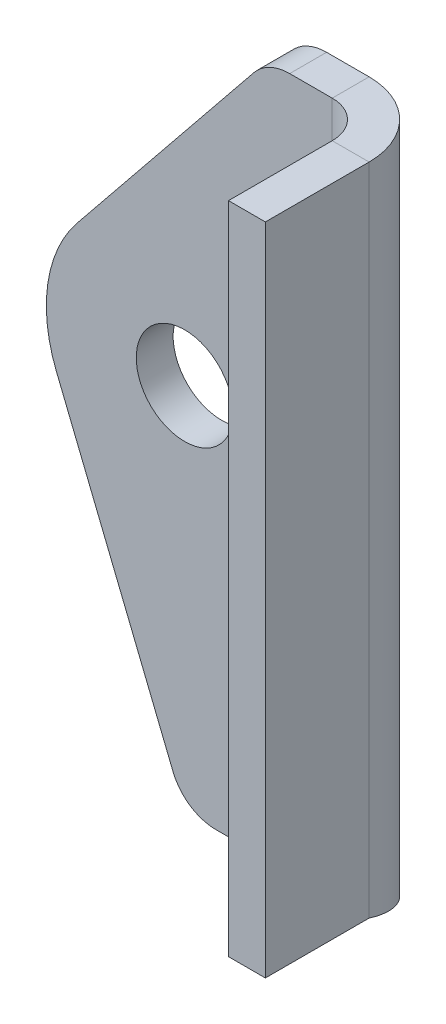
ISO-10303-21;
HEADER;
FILE_DESCRIPTION(('STEP AP214'),'2;1');
FILE_NAME('part.step','',(''),(''),'','','');
FILE_SCHEMA(('AUTOMOTIVE_DESIGN { 1 0 10303 214 1 1 1 1 }'));
ENDSEC;
DATA;
#1=APPLICATION_CONTEXT('core data for automotive mechanical design processes');
#2=APPLICATION_PROTOCOL_DEFINITION('international standard','automotive_design',2000,#1);
#3=PRODUCT_CONTEXT('',#1,'mechanical');
#4=PRODUCT('Part','Part','',(#3));
#5=PRODUCT_RELATED_PRODUCT_CATEGORY('part','',(#4));
#6=PRODUCT_DEFINITION_FORMATION('','',#4);
#7=PRODUCT_DEFINITION_CONTEXT('part definition',#1,'design');
#8=PRODUCT_DEFINITION('design','',#6,#7);
#9=PRODUCT_DEFINITION_SHAPE('','',#8);
#10=(LENGTH_UNIT() NAMED_UNIT(*) SI_UNIT(.MILLI.,.METRE.));
#11=(NAMED_UNIT(*) PLANE_ANGLE_UNIT() SI_UNIT($,.RADIAN.));
#12=(NAMED_UNIT(*) SI_UNIT($,.STERADIAN.) SOLID_ANGLE_UNIT());
#13=UNCERTAINTY_MEASURE_WITH_UNIT(LENGTH_MEASURE(1.E-05),#10,'distance_accuracy_value','');
#14=(GEOMETRIC_REPRESENTATION_CONTEXT(3) GLOBAL_UNCERTAINTY_ASSIGNED_CONTEXT((#13)) GLOBAL_UNIT_ASSIGNED_CONTEXT((#10,
#11,#12)) REPRESENTATION_CONTEXT('',''));
#15=CARTESIAN_POINT('',(0.,0.,0.));
#16=DIRECTION('',(0.,0.,1.));
#17=DIRECTION('',(1.,0.,0.));
#18=AXIS2_PLACEMENT_3D('',#15,#16,#17);
#19=CARTESIAN_POINT('',(0.,71.,-4.));
#20=DIRECTION('',(0.,1.,0.));
#21=DIRECTION('',(0.,0.,1.));
#22=AXIS2_PLACEMENT_3D('',#19,#20,#21);
#23=PLANE('',#22);
#24=DIRECTION('',(-1.,0.,0.));
#25=VECTOR('',#24,1.);
#26=CARTESIAN_POINT('',(0.,71.,0.));
#27=LINE('',#26,#25);
#28=CARTESIAN_POINT('',(-3.99999999999999,71.,0.));
#29=VERTEX_POINT('',#28);
#30=CARTESIAN_POINT('',(-8.61214355544532,71.,0.));
#31=VERTEX_POINT('',#30);
#32=EDGE_CURVE('E134',#29,#31,#27,.T.);
#33=ORIENTED_EDGE('',*,*,#32,.F.);
#34=DIRECTION('',(0.,0.,-1.));
#35=VECTOR('',#34,1.);
#36=CARTESIAN_POINT('',(-3.99999999999999,71.,0.));
#37=LINE('',#36,#35);
#38=CARTESIAN_POINT('',(-3.99999999999999,71.,-4.));
#39=VERTEX_POINT('',#38);
#40=EDGE_CURVE('E188',#29,#39,#37,.T.);
#41=ORIENTED_EDGE('',*,*,#40,.T.);
#42=DIRECTION('',(-1.,0.,0.));
#43=VECTOR('',#42,1.);
#44=CARTESIAN_POINT('',(0.,71.,-4.));
#45=LINE('',#44,#43);
#46=CARTESIAN_POINT('',(-8.61214355544532,71.,-4.));
#47=VERTEX_POINT('',#46);
#48=EDGE_CURVE('E94',#39,#47,#45,.T.);
#49=ORIENTED_EDGE('',*,*,#48,.T.);
#50=DIRECTION('',(0.,0.,1.));
#51=VECTOR('',#50,1.);
#52=CARTESIAN_POINT('',(-8.61214355544532,71.,-4.));
#53=LINE('',#52,#51);
#54=EDGE_CURVE('E40',#47,#31,#53,.T.);
#55=ORIENTED_EDGE('',*,*,#54,.T.);
#56=EDGE_LOOP('',(#33,#41,#49,#55));
#57=FACE_BOUND('',#56,.T.);
#58=ADVANCED_FACE('F37',(#57),#23,.T.);
#59=CARTESIAN_POINT('',(-8.61214355544532,66.,-4.));
#60=DIRECTION('',(0.,0.,-1.));
#61=DIRECTION('',(-1.,0.,0.));
#62=AXIS2_PLACEMENT_3D('',#59,#60,#61);
#63=PLANE('',#62);
#64=CARTESIAN_POINT('',(-20.,36.,-4.));
#65=DIRECTION('',(0.,0.,1.));
#66=DIRECTION('',(1.,0.,0.));
#67=AXIS2_PLACEMENT_3D('',#64,#65,#66);
#68=CIRCLE('',#67,5.24999999999999);
#69=CARTESIAN_POINT('',(-14.75,36.,-4.));
#70=VERTEX_POINT('',#69);
#71=EDGE_CURVE('E137',#70,#70,#68,.T.);
#72=ORIENTED_EDGE('',*,*,#71,.T.);
#73=EDGE_LOOP('',(#72));
#74=FACE_BOUND('',#73,.T.);
#75=ORIENTED_EDGE('',*,*,#48,.F.);
#76=DIRECTION('',(0.,1.,0.));
#77=VECTOR('',#76,1.);
#78=CARTESIAN_POINT('',(-3.99999999999999,71.,-4.));
#79=LINE('',#78,#77);
#80=CARTESIAN_POINT('',(-3.99999999999999,-4.,-4.));
#81=VERTEX_POINT('',#80);
#82=EDGE_CURVE('E186',#39,#81,#79,.F.);
#83=ORIENTED_EDGE('',*,*,#82,.T.);
#84=DIRECTION('',(1.,0.,0.));
#85=VECTOR('',#84,1.);
#86=CARTESIAN_POINT('',(-16.6290006876838,-4.,-4.));
#87=LINE('',#86,#85);
#88=CARTESIAN_POINT('',(-16.6290006876838,-4.00000000000001,-4.));
#89=VERTEX_POINT('',#88);
#90=EDGE_CURVE('E124',#89,#81,#87,.T.);
#91=ORIENTED_EDGE('',*,*,#90,.F.);
#92=CARTESIAN_POINT('',(-16.6290006876838,0.999999999999994,-4.));
#93=DIRECTION('',(0.,0.,1.));
#94=DIRECTION('',(-1.,0.,0.));
#95=AXIS2_PLACEMENT_3D('',#92,#93,#94);
#96=CIRCLE('',#95,5.);
#97=CARTESIAN_POINT('',(-21.2641247421186,-0.875000000000008,-4.));
#98=VERTEX_POINT('',#97);
#99=EDGE_CURVE('E109',#98,#89,#96,.T.);
#100=ORIENTED_EDGE('',*,*,#99,.F.);
#101=DIRECTION('',(0.375,-0.927024810886958,0.));
#102=VECTOR('',#101,1.);
#103=CARTESIAN_POINT('',(-33.9053721633044,30.375,-4.));
#104=LINE('',#103,#102);
#105=CARTESIAN_POINT('',(-33.9053721633044,30.375,-4.));
#106=VERTEX_POINT('',#105);
#107=EDGE_CURVE('E120',#106,#98,#104,.T.);
#108=ORIENTED_EDGE('',*,*,#107,.F.);
#109=CARTESIAN_POINT('',(-20.,36.,-4.));
#110=DIRECTION('',(0.,0.,1.));
#111=DIRECTION('',(1.,0.,0.));
#112=AXIS2_PLACEMENT_3D('',#109,#110,#111);
#113=CIRCLE('',#112,15.);
#114=CARTESIAN_POINT('',(-31.6663448192284,45.4284886678016,-4.));
#115=VERTEX_POINT('',#114);
#116=EDGE_CURVE('E127',#115,#106,#113,.T.);
#117=ORIENTED_EDGE('',*,*,#116,.F.);
#118=DIRECTION('',(-0.628565911186773,-0.777756321281892,0.));
#119=VECTOR('',#118,1.);
#120=CARTESIAN_POINT('',(-12.5009251618548,69.1428295559338,-4.));
#121=LINE('',#120,#119);
#122=CARTESIAN_POINT('',(-12.5009251618548,69.1428295559338,-4.));
#123=VERTEX_POINT('',#122);
#124=EDGE_CURVE('E129',#123,#115,#121,.T.);
#125=ORIENTED_EDGE('',*,*,#124,.F.);
#126=CARTESIAN_POINT('',(-8.61214355544532,66.,-4.));
#127=DIRECTION('',(0.,0.,1.));
#128=DIRECTION('',(-1.,0.,0.));
#129=AXIS2_PLACEMENT_3D('',#126,#127,#128);
#130=CIRCLE('',#129,5.);
#131=EDGE_CURVE('E267',#47,#123,#130,.T.);
#132=ORIENTED_EDGE('',*,*,#131,.F.);
#133=EDGE_LOOP('',(#75,#83,#91,#100,#108,#117,#125,#132));
#134=FACE_BOUND('',#133,.T.);
#135=ADVANCED_FACE('F118',(#74,#134),#63,.T.);
#136=CARTESIAN_POINT('',(-8.61214355544532,66.,0.));
#137=DIRECTION('',(0.,0.,-1.));
#138=DIRECTION('',(-1.,0.,0.));
#139=AXIS2_PLACEMENT_3D('',#136,#137,#138);
#140=PLANE('',#139);
#141=CARTESIAN_POINT('',(-20.,36.,0.));
#142=DIRECTION('',(0.,0.,1.));
#143=DIRECTION('',(1.,0.,0.));
#144=AXIS2_PLACEMENT_3D('',#141,#142,#143);
#145=CIRCLE('',#144,5.24999999999999);
#146=CARTESIAN_POINT('',(-14.75,36.,0.));
#147=VERTEX_POINT('',#146);
#148=EDGE_CURVE('E190',#147,#147,#145,.T.);
#149=ORIENTED_EDGE('',*,*,#148,.F.);
#150=EDGE_LOOP('',(#149));
#151=FACE_BOUND('',#150,.T.);
#152=DIRECTION('',(0.,1.,0.));
#153=VECTOR('',#152,1.);
#154=CARTESIAN_POINT('',(-3.99999999999999,71.,0.));
#155=LINE('',#154,#153);
#156=CARTESIAN_POINT('',(-3.99999999999999,-3.99999999999992,0.));
#157=VERTEX_POINT('',#156);
#158=EDGE_CURVE('E168',#29,#157,#155,.F.);
#159=ORIENTED_EDGE('',*,*,#158,.F.);
#160=ORIENTED_EDGE('',*,*,#32,.T.);
#161=CARTESIAN_POINT('',(-8.61214355544532,66.,0.));
#162=DIRECTION('',(0.,0.,1.));
#163=DIRECTION('',(-1.,0.,0.));
#164=AXIS2_PLACEMENT_3D('',#161,#162,#163);
#165=CIRCLE('',#164,5.);
#166=CARTESIAN_POINT('',(-12.5009251618548,69.1428295559338,0.));
#167=VERTEX_POINT('',#166);
#168=EDGE_CURVE('E136',#31,#167,#165,.T.);
#169=ORIENTED_EDGE('',*,*,#168,.T.);
#170=DIRECTION('',(-0.628565911186773,-0.777756321281892,0.));
#171=VECTOR('',#170,1.);
#172=CARTESIAN_POINT('',(-12.5009251618548,69.1428295559338,0.));
#173=LINE('',#172,#171);
#174=CARTESIAN_POINT('',(-31.6663448192284,45.4284886678016,0.));
#175=VERTEX_POINT('',#174);
#176=EDGE_CURVE('E140',#167,#175,#173,.T.);
#177=ORIENTED_EDGE('',*,*,#176,.T.);
#178=CARTESIAN_POINT('',(-20.,36.,0.));
#179=DIRECTION('',(0.,0.,1.));
#180=DIRECTION('',(1.,0.,0.));
#181=AXIS2_PLACEMENT_3D('',#178,#179,#180);
#182=CIRCLE('',#181,15.);
#183=CARTESIAN_POINT('',(-33.9053721633044,30.375,0.));
#184=VERTEX_POINT('',#183);
#185=EDGE_CURVE('E143',#175,#184,#182,.T.);
#186=ORIENTED_EDGE('',*,*,#185,.T.);
#187=DIRECTION('',(0.375,-0.927024810886958,0.));
#188=VECTOR('',#187,1.);
#189=CARTESIAN_POINT('',(-33.9053721633044,30.375,0.));
#190=LINE('',#189,#188);
#191=CARTESIAN_POINT('',(-21.2641247421186,-0.875000000000008,0.));
#192=VERTEX_POINT('',#191);
#193=EDGE_CURVE('E146',#184,#192,#190,.T.);
#194=ORIENTED_EDGE('',*,*,#193,.T.);
#195=CARTESIAN_POINT('',(-16.6290006876838,0.999999999999994,0.));
#196=DIRECTION('',(0.,0.,1.));
#197=DIRECTION('',(-1.,0.,0.));
#198=AXIS2_PLACEMENT_3D('',#195,#196,#197);
#199=CIRCLE('',#198,5.);
#200=CARTESIAN_POINT('',(-16.6290006876838,-4.00000000000001,0.));
#201=VERTEX_POINT('',#200);
#202=EDGE_CURVE('E111',#192,#201,#199,.T.);
#203=ORIENTED_EDGE('',*,*,#202,.T.);
#204=DIRECTION('',(1.,0.,0.));
#205=VECTOR('',#204,1.);
#206=CARTESIAN_POINT('',(-16.6290006876838,-4.,0.));
#207=LINE('',#206,#205);
#208=EDGE_CURVE('E149',#201,#157,#207,.T.);
#209=ORIENTED_EDGE('',*,*,#208,.T.);
#210=EDGE_LOOP('',(#159,#160,#169,#177,#186,#194,#203,#209));
#211=FACE_BOUND('',#210,.T.);
#212=ADVANCED_FACE('F166',(#151,#211),#140,.F.);
#213=CARTESIAN_POINT('',(-16.6290006876838,-4.,-4.));
#214=DIRECTION('',(0.,-1.,0.));
#215=DIRECTION('',(0.,0.,-1.));
#216=AXIS2_PLACEMENT_3D('',#213,#214,#215);
#217=PLANE('',#216);
#218=ORIENTED_EDGE('',*,*,#208,.F.);
#219=DIRECTION('',(0.,0.,1.));
#220=VECTOR('',#219,1.);
#221=CARTESIAN_POINT('',(-16.6290006876838,-4.00000000000001,-4.));
#222=LINE('',#221,#220);
#223=EDGE_CURVE('E46',#89,#201,#222,.T.);
#224=ORIENTED_EDGE('',*,*,#223,.F.);
#225=ORIENTED_EDGE('',*,*,#90,.T.);
#226=DIRECTION('',(0.,0.,1.));
#227=VECTOR('',#226,1.);
#228=CARTESIAN_POINT('',(-3.99999999999999,-4.,-4.));
#229=LINE('',#228,#227);
#230=EDGE_CURVE('E11',#81,#157,#229,.T.);
#231=ORIENTED_EDGE('',*,*,#230,.T.);
#232=EDGE_LOOP('',(#218,#224,#225,#231));
#233=FACE_BOUND('',#232,.T.);
#234=ADVANCED_FACE('F230',(#233),#217,.T.);
#235=CARTESIAN_POINT('',(-16.6290006876838,0.999999999999994,-4.));
#236=DIRECTION('',(0.,0.,1.));
#237=DIRECTION('',(1.,0.,0.));
#238=AXIS2_PLACEMENT_3D('',#235,#236,#237);
#239=CYLINDRICAL_SURFACE('',#238,5.);
#240=ORIENTED_EDGE('',*,*,#202,.F.);
#241=DIRECTION('',(0.,0.,1.));
#242=VECTOR('',#241,1.);
#243=CARTESIAN_POINT('',(-21.2641247421186,-0.875000000000008,-4.));
#244=LINE('',#243,#242);
#245=EDGE_CURVE('E80',#98,#192,#244,.T.);
#246=ORIENTED_EDGE('',*,*,#245,.F.);
#247=ORIENTED_EDGE('',*,*,#99,.T.);
#248=ORIENTED_EDGE('',*,*,#223,.T.);
#249=EDGE_LOOP('',(#240,#246,#247,#248));
#250=FACE_BOUND('',#249,.T.);
#251=ADVANCED_FACE('F108',(#250),#239,.T.);
#252=CARTESIAN_POINT('',(-33.9053721633044,30.375,-4.));
#253=DIRECTION('',(-0.927024810886958,-0.375,0.));
#254=DIRECTION('',(0.375,-0.927024810886958,0.));
#255=AXIS2_PLACEMENT_3D('',#252,#253,#254);
#256=PLANE('',#255);
#257=ORIENTED_EDGE('',*,*,#193,.F.);
#258=DIRECTION('',(0.,0.,1.));
#259=VECTOR('',#258,1.);
#260=CARTESIAN_POINT('',(-33.9053721633044,30.375,-4.));
#261=LINE('',#260,#259);
#262=EDGE_CURVE('E113',#106,#184,#261,.T.);
#263=ORIENTED_EDGE('',*,*,#262,.F.);
#264=ORIENTED_EDGE('',*,*,#107,.T.);
#265=ORIENTED_EDGE('',*,*,#245,.T.);
#266=EDGE_LOOP('',(#257,#263,#264,#265));
#267=FACE_BOUND('',#266,.T.);
#268=ADVANCED_FACE('F126',(#267),#256,.T.);
#269=CARTESIAN_POINT('',(-20.,36.,-4.));
#270=DIRECTION('',(0.,0.,1.));
#271=DIRECTION('',(1.,0.,0.));
#272=AXIS2_PLACEMENT_3D('',#269,#270,#271);
#273=CYLINDRICAL_SURFACE('',#272,15.);
#274=ORIENTED_EDGE('',*,*,#185,.F.);
#275=DIRECTION('',(0.,0.,1.));
#276=VECTOR('',#275,1.);
#277=CARTESIAN_POINT('',(-31.6663448192284,45.4284886678016,-4.));
#278=LINE('',#277,#276);
#279=EDGE_CURVE('E154',#115,#175,#278,.T.);
#280=ORIENTED_EDGE('',*,*,#279,.F.);
#281=ORIENTED_EDGE('',*,*,#116,.T.);
#282=ORIENTED_EDGE('',*,*,#262,.T.);
#283=EDGE_LOOP('',(#274,#280,#281,#282));
#284=FACE_BOUND('',#283,.T.);
#285=ADVANCED_FACE('F244',(#284),#273,.T.);
#286=CARTESIAN_POINT('',(-12.5009251618548,69.1428295559338,-4.));
#287=DIRECTION('',(-0.777756321281892,0.628565911186773,0.));
#288=DIRECTION('',(-0.628565911186773,-0.777756321281892,0.));
#289=AXIS2_PLACEMENT_3D('',#286,#287,#288);
#290=PLANE('',#289);
#291=ORIENTED_EDGE('',*,*,#176,.F.);
#292=DIRECTION('',(0.,0.,1.));
#293=VECTOR('',#292,1.);
#294=CARTESIAN_POINT('',(-12.5009251618548,69.1428295559338,-4.));
#295=LINE('',#294,#293);
#296=EDGE_CURVE('E155',#123,#167,#295,.T.);
#297=ORIENTED_EDGE('',*,*,#296,.F.);
#298=ORIENTED_EDGE('',*,*,#124,.T.);
#299=ORIENTED_EDGE('',*,*,#279,.T.);
#300=EDGE_LOOP('',(#291,#297,#298,#299));
#301=FACE_BOUND('',#300,.T.);
#302=ADVANCED_FACE('F247',(#301),#290,.T.);
#303=CARTESIAN_POINT('',(-8.61214355544532,66.,-4.));
#304=DIRECTION('',(0.,0.,1.));
#305=DIRECTION('',(1.,0.,0.));
#306=AXIS2_PLACEMENT_3D('',#303,#304,#305);
#307=CYLINDRICAL_SURFACE('',#306,5.);
#308=ORIENTED_EDGE('',*,*,#168,.F.);
#309=ORIENTED_EDGE('',*,*,#54,.F.);
#310=ORIENTED_EDGE('',*,*,#131,.T.);
#311=ORIENTED_EDGE('',*,*,#296,.T.);
#312=EDGE_LOOP('',(#308,#309,#310,#311));
#313=FACE_BOUND('',#312,.T.);
#314=ADVANCED_FACE('F163',(#313),#307,.T.);
#315=CARTESIAN_POINT('',(-20.,36.,-4.));
#316=DIRECTION('',(0.,0.,1.));
#317=DIRECTION('',(1.,0.,0.));
#318=AXIS2_PLACEMENT_3D('',#315,#316,#317);
#319=CYLINDRICAL_SURFACE('',#318,5.24999999999999);
#320=ORIENTED_EDGE('',*,*,#71,.F.);
#321=EDGE_LOOP('',(#320));
#322=FACE_BOUND('',#321,.T.);
#323=ORIENTED_EDGE('',*,*,#148,.T.);
#324=EDGE_LOOP('',(#323));
#325=FACE_BOUND('',#324,.T.);
#326=ADVANCED_FACE('F235',(#322,#325),#319,.F.);
#327=CARTESIAN_POINT('',(-3.99999999999999,-3.99999999999992,-4.04));
#328=CARTESIAN_POINT('',(-2.94739398175699,-3.66661197863573,-4.04));
#329=CARTESIAN_POINT('',(-1.89554700975138,-3.33333333333327,-3.83074032041326));
#330=CARTESIAN_POINT('',(0.049096602182035,-2.66666666666662,-3.02524256236824));
#331=CARTESIAN_POINT('',(0.940955628598319,-2.33333333333329,-2.42932141288138));
#332=CARTESIAN_POINT('',(2.42932141288137,-1.66666666666663,-0.94095562859833));
#333=CARTESIAN_POINT('',(3.02524256236824,-1.3333333333333,-0.0490966021820493));
#334=CARTESIAN_POINT('',(3.83074032041326,-0.666666666666646,1.89554700975136));
#335=CARTESIAN_POINT('',(4.04000000000001,-0.333388021364189,2.94739398175698));
#336=CARTESIAN_POINT('',(4.04000000000001,0.,3.99999999999997));
#337=CARTESIAN_POINT('',(-3.99999999999999,-3.99999999999992,-4.));
#338=CARTESIAN_POINT('',(-2.95263101210554,-3.66661209667081,-4.));
#339=CARTESIAN_POINT('',(-1.90601692512575,-3.33333333333327,-3.79178141334653));
#340=CARTESIAN_POINT('',(0.0289518429671991,-2.66666666666662,-2.99029110683407));
#341=CARTESIAN_POINT('',(0.916373759799322,-2.33333333333329,-2.39733473918545));
#342=CARTESIAN_POINT('',(2.39733473918544,-1.66666666666663,-0.916373759799334));
#343=CARTESIAN_POINT('',(2.99029110683407,-1.3333333333333,-0.0289518429672132));
#344=CARTESIAN_POINT('',(3.79178141334653,-0.666666666666646,1.90601692512573));
#345=CARTESIAN_POINT('',(4.00000000000001,-0.333387903329109,2.95263101210552));
#346=CARTESIAN_POINT('',(4.00000000000001,0.,3.99999999999997));
#347=CARTESIAN_POINT('',(-3.99999999999999,-3.99999999999992,0.));
#348=CARTESIAN_POINT('',(-3.47633404695986,-3.66662390017887,0.));
#349=CARTESIAN_POINT('',(-2.95300846256287,-3.33333333333327,0.104109293326737));
#350=CARTESIAN_POINT('',(-1.98552407851639,-2.66666666666662,0.504854446582966));
#351=CARTESIAN_POINT('',(-1.54181312010033,-2.33333333333329,0.801332630407276));
#352=CARTESIAN_POINT('',(-0.801332630407272,-1.66666666666663,1.54181312010033));
#353=CARTESIAN_POINT('',(-0.50485444658296,-1.3333333333333,1.98552407851639));
#354=CARTESIAN_POINT('',(-0.104109293326727,-0.666666666666646,2.95300846256287));
#355=CARTESIAN_POINT('',(0.,-0.333376099821049,3.47633404695986));
#356=CARTESIAN_POINT('',(0.,0.,3.99999999999998));
#357=CARTESIAN_POINT('',(-3.99999999999999,-3.99999999999992,0.0404));
#358=CARTESIAN_POINT('',(-3.48162344761189,-3.6666240193943,0.0403999999999999));
#359=CARTESIAN_POINT('',(-2.96358307709098,-3.33333333333327,0.143457789464137));
#360=CARTESIAN_POINT('',(-2.00587028532338,-2.66666666666662,0.540155416672478));
#361=CARTESIAN_POINT('',(-1.56664080758732,-2.33333333333329,0.833639170840162));
#362=CARTESIAN_POINT('',(-0.833639170840158,-1.66666666666663,1.56664080758732));
#363=CARTESIAN_POINT('',(-0.540155416672472,-1.3333333333333,2.00587028532338));
#364=CARTESIAN_POINT('',(-0.143457789464127,-0.666666666666646,2.96358307709098));
#365=CARTESIAN_POINT('',(-0.0403999999999881,-0.333375980605618,3.48162344761189));
#366=CARTESIAN_POINT('',(-0.0403999999999861,0.,3.99999999999998));
#367=B_SPLINE_SURFACE_WITH_KNOTS('',1,3,((#327,#328,#329,#330,#331,#332,#333,#334,#335,#336),
(#337,#338,#339,#340,#341,#342,#343,#344,#345,#346),(#347,#348,#349,#350,#351,#352,#353,#354,
#355,#356),(#357,#358,#359,#360,#361,#362,#363,#364,#365,#366)),.UNSPECIFIED.,.F.,.F.,.F.,(2,1,
1,2),(4,2,2,2,4),(-0.01,0.,1.,1.0101),(0.,0.25,0.5,0.75,1.),.UNSPECIFIED.);
#368=DIRECTION('',(1.,0.,0.));
#369=VECTOR('',#368,1.);
#370=CARTESIAN_POINT('',(0.,0.,3.99999999999999));
#371=LINE('',#370,#369);
#372=CARTESIAN_POINT('',(0.,0.,3.99999999999999));
#373=VERTEX_POINT('',#372);
#374=CARTESIAN_POINT('',(4.00000000000001,0.,3.99999999999997));
#375=VERTEX_POINT('',#374);
#376=EDGE_CURVE('E287',#373,#375,#371,.T.);
#377=CARTESIAN_POINT('',(-3.99999999999999,-3.99999999999992,0.));
#378=CARTESIAN_POINT('',(-3.85615338583754,-3.90841856986971,-3.27360622396403E-05));
#379=CARTESIAN_POINT('',(-3.71230915607617,-3.81684184187781,0.00775789564035587));
#380=CARTESIAN_POINT('',(-3.42629063809643,-3.63369419317211,0.0387529524772841));
#381=CARTESIAN_POINT('',(-3.28411631499031,-3.54212327237688,0.0619570550078345));
#382=CARTESIAN_POINT('',(-3.00330578650783,-3.35911612229636,0.123500288575134));
#383=CARTESIAN_POINT('',(-2.86466462931857,-3.26767989542489,0.161816838096101));
#384=CARTESIAN_POINT('',(-2.5923178555934,-3.08481099798957,0.253127992724512));
#385=CARTESIAN_POINT('',(-2.45861175263192,-2.99337832796735,0.306121146824689));
#386=CARTESIAN_POINT('',(-2.20681732074895,-2.8169237506515,0.421964584429487));
#387=CARTESIAN_POINT('',(-2.08829099612395,-2.73190129240949,0.483864709532238));
#388=CARTESIAN_POINT('',(-1.85801799367404,-2.56186229478322,0.619209222000039));
#389=CARTESIAN_POINT('',(-1.74627121417913,-2.47684575532931,0.692653436183857));
#390=CARTESIAN_POINT('',(-1.53074690827519,-2.30685612752634,0.850300630208482));
#391=CARTESIAN_POINT('',(-1.4269648759593,-2.22188304203025,0.934497454051532));
#392=CARTESIAN_POINT('',(-1.22833532804377,-2.05193595626958,1.11284061277288));
#393=CARTESIAN_POINT('',(-1.13348778350902,-1.96696195600886,1.20698691542684));
#394=CARTESIAN_POINT('',(-0.953701182760443,-1.79703836101654,1.40425945497608));
#395=CARTESIAN_POINT('',(-0.868759364175964,-1.71208876610261,1.50738317429719));
#396=CARTESIAN_POINT('',(-0.709566446137755,-1.54215772454986,1.72165249926372));
#397=CARTESIAN_POINT('',(-0.635320104156827,-1.45717628049143,1.83280164191331));
#398=CARTESIAN_POINT('',(-0.498290313130832,-1.28718194119383,2.06199506212819));
#399=CARTESIAN_POINT('',(-0.435510407230762,-1.20216904433946,2.18004145613162));
#400=CARTESIAN_POINT('',(-0.322095287447351,-1.03218209532399,2.42176420955729));
#401=CARTESIAN_POINT('',(-0.271453985191595,-0.947208045115573,2.54543770939265));
#402=CARTESIAN_POINT('',(-0.189613566798372,-0.790354837220069,2.7778258329359));
#403=CARTESIAN_POINT('',(-0.156621546293488,-0.718473688212542,2.8859121839736));
#404=CARTESIAN_POINT('',(-0.0998982507651219,-0.574721473013303,3.10448229579448));
#405=CARTESIAN_POINT('',(-0.0761659306961605,-0.502850406599421,3.21496578455127));
#406=CARTESIAN_POINT('',(-0.0381473521612832,-0.359156070907527,3.43746417516191));
#407=CARTESIAN_POINT('',(-0.0238545412986121,-0.287332803119648,3.54947795952372));
#408=CARTESIAN_POINT('',(-0.00477415167049791,-0.143673412859799,3.77432717706241));
#409=CARTESIAN_POINT('',(1.20217732822251E-05,-0.0718372900569932,3.88716272924335));
#410=CARTESIAN_POINT('',(0.,0.,3.99999999999998));
#411=B_SPLINE_CURVE_WITH_KNOTS('',3,(#377,#378,#379,#380,#381,#382,#383,#384,#385,#386,#387,
#388,#389,#390,#391,#392,#393,#394,#395,#396,#397,#398,#399,#400,#401,#402,#403,#404,#405,#406,
#407,#408,#409,#410),.UNSPECIFIED.,.F.,.F.,(4,2,2,2,2,2,2,2,2,2,2,2,2,2,2,2,4),(0.,
0.511393076631522,1.02277545014857,1.53339657671346,2.04396723856523,2.51878338880138,
2.99359241665668,3.46813081916144,3.94266768478033,4.41707190012329,4.89168648868351,
5.36644748662044,5.84096985754373,6.24243837673698,6.643861573265,7.04500582983098,
7.44620938126075),.UNSPECIFIED.);
#412=EDGE_CURVE('E177',#157,#373,#411,.T.);
#413=CARTESIAN_POINT('',(-3.99999999999999,-3.99999999999992,-4.));
#414=CARTESIAN_POINT('',(-3.76382973956477,-3.92482144294102,-4.00002933303085));
#415=CARTESIAN_POINT('',(-3.52766337175178,-3.84964450002727,-3.98954316416955));
#416=CARTESIAN_POINT('',(-3.05719085241453,-3.69929783554371,-3.94775153871865));
#417=CARTESIAN_POINT('',(-2.82288460284421,-3.62412811380237,-3.91644718691933));
#418=CARTESIAN_POINT('',(-2.35814237749886,-3.47385110652067,-3.83326363947987));
#419=CARTESIAN_POINT('',(-2.12770349893277,-3.39874381843287,-3.78140066745633));
#420=CARTESIAN_POINT('',(-1.67231544623998,-3.24852340259569,-3.65751636513786));
#421=CARTESIAN_POINT('',(-1.44736619957088,-3.17341027493665,-3.58549530137776));
#422=CARTESIAN_POINT('',(-1.00455521922925,-3.02313150436366,-3.42179706225379));
#423=CARTESIAN_POINT('',(-0.786698624395103,-2.94796586197955,-3.3301059850255));
#424=CARTESIAN_POINT('',(-0.359943199093956,-2.7976327442188,-3.12781508629274));
#425=CARTESIAN_POINT('',(-0.151044558150645,-2.72246526883702,-3.01721486497359));
#426=CARTESIAN_POINT('',(0.25610364877708,-2.57215592491327,-2.77800231859268));
#427=CARTESIAN_POINT('',(0.45435587773028,-2.49701405468332,-2.64939452704037));
#428=CARTESIAN_POINT('',(0.838710716658796,-2.34672637532903,-2.3751558787222));
#429=CARTESIAN_POINT('',(1.02481340528489,-2.27158056623335,-2.2295251321725));
#430=CARTESIAN_POINT('',(1.38340287347112,-2.12129092071119,-1.92238969203756));
#431=CARTESIAN_POINT('',(1.55589046838197,-2.0461470844364,-1.76088595032172));
#432=CARTESIAN_POINT('',(1.88591181955753,-1.89585842325094,-1.42326177776662));
#433=CARTESIAN_POINT('',(2.04344557340163,-1.82071359834011,-1.24714134456135));
#434=CARTESIAN_POINT('',(2.34238426589708,-1.67040073790195,-0.881591014425751));
#435=CARTESIAN_POINT('',(2.48378298171914,-1.59523270455532,-0.692156027657611));
#436=CARTESIAN_POINT('',(2.74926888073529,-1.44489971478537,-0.301527222581648));
#437=CARTESIAN_POINT('',(2.87335649840924,-1.36973475833217,-0.100333699573496));
#438=CARTESIAN_POINT('',(3.1033004296577,-1.21936567662462,0.312326179934207));
#439=CARTESIAN_POINT('',(3.2091488664563,-1.14416154844569,0.523796924466439));
#440=CARTESIAN_POINT('',(3.40171817085541,-0.993756183741791,0.955270288111989));
#441=CARTESIAN_POINT('',(3.4884394801028,-0.918554947190153,1.17527271009026));
#442=CARTESIAN_POINT('',(3.64200170904213,-0.768227422716092,1.62186755008796));
#443=CARTESIAN_POINT('',(3.70886194483744,-0.693101133262126,1.84845332832191));
#444=CARTESIAN_POINT('',(3.82227201887794,-0.542881735344299,2.30656581205216));
#445=CARTESIAN_POINT('',(3.86882994831725,-0.467788625598747,2.53809051055409));
#446=CARTESIAN_POINT('',(3.93667628461908,-0.327190427888299,2.97456519162785));
#447=CARTESIAN_POINT('',(3.9604314621024,-0.261684860120281,3.17913544702507));
#448=CARTESIAN_POINT('',(3.99208685541111,-0.130787381639027,3.58913437095156));
#449=CARTESIAN_POINT('',(4.00001500401032,-0.0653954745555598,3.79456088481697));
#450=CARTESIAN_POINT('',(4.00000000000001,0.,3.99999999999997));
#451=B_SPLINE_CURVE_WITH_KNOTS('',3,(#413,#414,#415,#416,#417,#418,#419,#420,#421,#422,#423,
#424,#425,#426,#427,#428,#429,#430,#431,#432,#433,#434,#435,#436,#437,#438,#439,#440,#441,#442,
#443,#444,#445,#446,#447,#448,#449,#450),.UNSPECIFIED.,.F.,.F.,(4,2,2,2,2,2,2,2,2,2,2,2,2,2,2,2,
2,2,4),(0.,0.743313797486379,1.48658815155323,2.22927712252205,2.97195627395398,
3.71516205649514,4.45838355531239,5.20141827914482,5.94444819242014,6.68743357494501,
7.43041907773833,8.17369016747089,8.91694259897356,9.66051521149889,10.4040706530766,
11.1469005561134,11.8894341437368,12.5371968949301,13.1838154096717),.UNSPECIFIED.);
#452=EDGE_CURVE('E55',#81,#375,#451,.T.);
#453=ORIENTED_EDGE('',*,*,#376,.F.);
#454=ORIENTED_EDGE('',*,*,#412,.F.);
#455=ORIENTED_EDGE('',*,*,#230,.F.);
#456=ORIENTED_EDGE('',*,*,#452,.T.);
#457=EDGE_LOOP('',(#453,#454,#455,#456));
#458=FACE_BOUND('',#457,.T.);
#459=ADVANCED_FACE('F201',(#458),#367,.F.);
#460=CARTESIAN_POINT('',(-3.99999999999999,71.,4.));
#461=DIRECTION('',(0.,-1.,0.));
#462=DIRECTION('',(0.,0.,-1.));
#463=AXIS2_PLACEMENT_3D('',#460,#461,#462);
#464=PLANE('',#463);
#465=CARTESIAN_POINT('',(-3.99999999999999,71.,4.));
#466=DIRECTION('',(0.,1.,0.));
#467=DIRECTION('',(0.,0.,1.));
#468=AXIS2_PLACEMENT_3D('',#465,#466,#467);
#469=CIRCLE('',#468,4.);
#470=CARTESIAN_POINT('',(0.,71.,3.99999999999999));
#471=VERTEX_POINT('',#470);
#472=EDGE_CURVE('E178',#471,#29,#469,.T.);
#473=ORIENTED_EDGE('',*,*,#472,.F.);
#474=DIRECTION('',(1.,0.,0.));
#475=VECTOR('',#474,1.);
#476=CARTESIAN_POINT('',(0.,71.,3.99999999999999));
#477=LINE('',#476,#475);
#478=CARTESIAN_POINT('',(4.00000000000001,71.,3.99999999999997));
#479=VERTEX_POINT('',#478);
#480=EDGE_CURVE('E312',#471,#479,#477,.T.);
#481=ORIENTED_EDGE('',*,*,#480,.T.);
#482=CARTESIAN_POINT('',(-3.99999999999999,71.,4.));
#483=DIRECTION('',(0.,1.,0.));
#484=DIRECTION('',(0.,0.,1.));
#485=AXIS2_PLACEMENT_3D('',#482,#483,#484);
#486=CIRCLE('',#485,8.);
#487=EDGE_CURVE('E180',#479,#39,#486,.T.);
#488=ORIENTED_EDGE('',*,*,#487,.T.);
#489=ORIENTED_EDGE('',*,*,#40,.F.);
#490=EDGE_LOOP('',(#473,#481,#488,#489));
#491=FACE_BOUND('',#490,.T.);
#492=ADVANCED_FACE('F211',(#491),#464,.F.);
#493=CARTESIAN_POINT('',(-3.99999999999999,71.,4.));
#494=DIRECTION('',(0.,1.,0.));
#495=DIRECTION('',(1.,0.,0.));
#496=AXIS2_PLACEMENT_3D('',#493,#494,#495);
#497=CYLINDRICAL_SURFACE('',#496,8.);
#498=ORIENTED_EDGE('',*,*,#82,.F.);
#499=ORIENTED_EDGE('',*,*,#487,.F.);
#500=DIRECTION('',(0.,-1.,0.));
#501=VECTOR('',#500,1.);
#502=CARTESIAN_POINT('',(4.00000000000001,0.,3.99999999999997));
#503=LINE('',#502,#501);
#504=EDGE_CURVE('E310',#479,#375,#503,.T.);
#505=ORIENTED_EDGE('',*,*,#504,.T.);
#506=ORIENTED_EDGE('',*,*,#452,.F.);
#507=EDGE_LOOP('',(#498,#499,#505,#506));
#508=FACE_BOUND('',#507,.T.);
#509=ADVANCED_FACE('F206',(#508),#497,.T.);
#510=CARTESIAN_POINT('',(-3.99999999999999,71.,4.));
#511=DIRECTION('',(0.,1.,0.));
#512=DIRECTION('',(1.,0.,0.));
#513=AXIS2_PLACEMENT_3D('',#510,#511,#512);
#514=CYLINDRICAL_SURFACE('',#513,4.);
#515=ORIENTED_EDGE('',*,*,#158,.T.);
#516=ORIENTED_EDGE('',*,*,#412,.T.);
#517=DIRECTION('',(0.,1.,0.));
#518=VECTOR('',#517,1.);
#519=CARTESIAN_POINT('',(0.,0.,3.99999999999999));
#520=LINE('',#519,#518);
#521=EDGE_CURVE('E282',#373,#471,#520,.T.);
#522=ORIENTED_EDGE('',*,*,#521,.T.);
#523=ORIENTED_EDGE('',*,*,#472,.T.);
#524=EDGE_LOOP('',(#515,#516,#522,#523));
#525=FACE_BOUND('',#524,.T.);
#526=ADVANCED_FACE('F210',(#525),#514,.F.);
#527=CARTESIAN_POINT('',(4.00000000000005,71.,15.25));
#528=DIRECTION('',(0.,-1.,0.));
#529=DIRECTION('',(1.,0.,0.));
#530=AXIS2_PLACEMENT_3D('',#527,#528,#529);
#531=PLANE('',#530);
#532=ORIENTED_EDGE('',*,*,#480,.F.);
#533=DIRECTION('',(0.,0.,1.));
#534=VECTOR('',#533,1.);
#535=CARTESIAN_POINT('',(0.,71.,15.25));
#536=LINE('',#535,#534);
#537=CARTESIAN_POINT('',(0.,71.,15.25));
#538=VERTEX_POINT('',#537);
#539=EDGE_CURVE('E305',#471,#538,#536,.T.);
#540=ORIENTED_EDGE('',*,*,#539,.T.);
#541=DIRECTION('',(-1.,0.,0.));
#542=VECTOR('',#541,1.);
#543=CARTESIAN_POINT('',(4.00000000000005,71.,15.25));
#544=LINE('',#543,#542);
#545=CARTESIAN_POINT('',(4.00000000000005,71.,15.25));
#546=VERTEX_POINT('',#545);
#547=EDGE_CURVE('E182',#546,#538,#544,.T.);
#548=ORIENTED_EDGE('',*,*,#547,.F.);
#549=DIRECTION('',(0.,0.,1.));
#550=VECTOR('',#549,1.);
#551=CARTESIAN_POINT('',(4.00000000000005,71.,15.25));
#552=LINE('',#551,#550);
#553=EDGE_CURVE('E316',#479,#546,#552,.T.);
#554=ORIENTED_EDGE('',*,*,#553,.F.);
#555=EDGE_LOOP('',(#532,#540,#548,#554));
#556=FACE_BOUND('',#555,.T.);
#557=ADVANCED_FACE('F212',(#556),#531,.F.);
#558=CARTESIAN_POINT('',(4.,0.,0.));
#559=DIRECTION('',(0.,1.,0.));
#560=DIRECTION('',(-1.,0.,0.));
#561=AXIS2_PLACEMENT_3D('',#558,#559,#560);
#562=PLANE('',#561);
#563=ORIENTED_EDGE('',*,*,#376,.T.);
#564=DIRECTION('',(0.,0.,-1.));
#565=VECTOR('',#564,1.);
#566=CARTESIAN_POINT('',(4.,0.,0.));
#567=LINE('',#566,#565);
#568=CARTESIAN_POINT('',(4.00000000000005,0.,15.25));
#569=VERTEX_POINT('',#568);
#570=EDGE_CURVE('E318',#569,#375,#567,.T.);
#571=ORIENTED_EDGE('',*,*,#570,.F.);
#572=DIRECTION('',(-1.,0.,0.));
#573=VECTOR('',#572,1.);
#574=CARTESIAN_POINT('',(4.00000000000005,0.,15.25));
#575=LINE('',#574,#573);
#576=CARTESIAN_POINT('',(0.,0.,15.25));
#577=VERTEX_POINT('',#576);
#578=EDGE_CURVE('E329',#569,#577,#575,.T.);
#579=ORIENTED_EDGE('',*,*,#578,.T.);
#580=DIRECTION('',(0.,0.,-1.));
#581=VECTOR('',#580,1.);
#582=CARTESIAN_POINT('',(0.,0.,0.));
#583=LINE('',#582,#581);
#584=EDGE_CURVE('E320',#577,#373,#583,.T.);
#585=ORIENTED_EDGE('',*,*,#584,.T.);
#586=EDGE_LOOP('',(#563,#571,#579,#585));
#587=FACE_BOUND('',#586,.T.);
#588=ADVANCED_FACE('F219',(#587),#562,.F.);
#589=CARTESIAN_POINT('',(4.,0.,0.));
#590=DIRECTION('',(-1.,0.,0.));
#591=DIRECTION('',(0.,0.,1.));
#592=AXIS2_PLACEMENT_3D('',#589,#590,#591);
#593=PLANE('',#592);
#594=ORIENTED_EDGE('',*,*,#504,.F.);
#595=ORIENTED_EDGE('',*,*,#553,.T.);
#596=DIRECTION('',(0.,-1.,0.));
#597=VECTOR('',#596,1.);
#598=CARTESIAN_POINT('',(4.00000000000005,0.,15.25));
#599=LINE('',#598,#597);
#600=EDGE_CURVE('E295',#546,#569,#599,.T.);
#601=ORIENTED_EDGE('',*,*,#600,.T.);
#602=ORIENTED_EDGE('',*,*,#570,.T.);
#603=EDGE_LOOP('',(#594,#595,#601,#602));
#604=FACE_BOUND('',#603,.T.);
#605=ADVANCED_FACE('F315',(#604),#593,.F.);
#606=CARTESIAN_POINT('',(0.,0.,0.));
#607=DIRECTION('',(-1.,0.,0.));
#608=DIRECTION('',(0.,0.,1.));
#609=AXIS2_PLACEMENT_3D('',#606,#607,#608);
#610=PLANE('',#609);
#611=ORIENTED_EDGE('',*,*,#539,.F.);
#612=ORIENTED_EDGE('',*,*,#521,.F.);
#613=ORIENTED_EDGE('',*,*,#584,.F.);
#614=DIRECTION('',(0.,-1.,0.));
#615=VECTOR('',#614,1.);
#616=CARTESIAN_POINT('',(0.,0.,15.25));
#617=LINE('',#616,#615);
#618=EDGE_CURVE('E324',#538,#577,#617,.T.);
#619=ORIENTED_EDGE('',*,*,#618,.F.);
#620=EDGE_LOOP('',(#611,#612,#613,#619));
#621=FACE_BOUND('',#620,.T.);
#622=ADVANCED_FACE('F339',(#621),#610,.T.);
#623=CARTESIAN_POINT('',(4.00000000000005,0.,15.25));
#624=DIRECTION('',(0.,0.,-1.));
#625=DIRECTION('',(-1.,0.,0.));
#626=AXIS2_PLACEMENT_3D('',#623,#624,#625);
#627=PLANE('',#626);
#628=ORIENTED_EDGE('',*,*,#618,.T.);
#629=ORIENTED_EDGE('',*,*,#578,.F.);
#630=ORIENTED_EDGE('',*,*,#600,.F.);
#631=ORIENTED_EDGE('',*,*,#547,.T.);
#632=EDGE_LOOP('',(#628,#629,#630,#631));
#633=FACE_BOUND('',#632,.T.);
#634=ADVANCED_FACE('F336',(#633),#627,.F.);
#635=CLOSED_SHELL('',(#58,#135,#212,#234,#251,#268,#285,#302,#314,#326,#459,#492,#509,#526,#557,
#588,#605,#622,#634));
#636=MANIFOLD_SOLID_BREP('B2',#635);
#637=ADVANCED_BREP_SHAPE_REPRESENTATION('',(#18,#636),#14);
#638=SHAPE_DEFINITION_REPRESENTATION(#9,#637);
ENDSEC;
END-ISO-10303-21;
